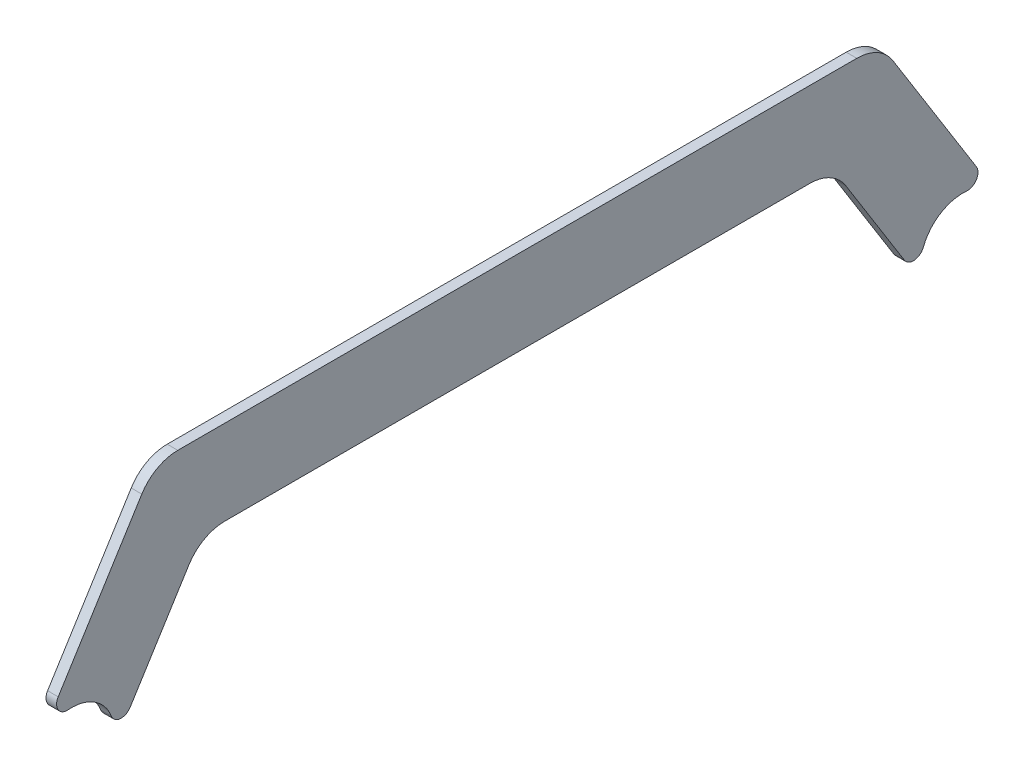
ISO-10303-21;
HEADER;
FILE_DESCRIPTION(('STEP AP214'),'2;1');
FILE_NAME('part.step','',(''),(''),'','','');
FILE_SCHEMA(('AUTOMOTIVE_DESIGN { 1 0 10303 214 1 1 1 1 }'));
ENDSEC;
DATA;
#1=APPLICATION_CONTEXT('core data for automotive mechanical design processes');
#2=APPLICATION_PROTOCOL_DEFINITION('international standard','automotive_design',2000,#1);
#3=PRODUCT_CONTEXT('',#1,'mechanical');
#4=PRODUCT('Part','Part','',(#3));
#5=PRODUCT_RELATED_PRODUCT_CATEGORY('part','',(#4));
#6=PRODUCT_DEFINITION_FORMATION('','',#4);
#7=PRODUCT_DEFINITION_CONTEXT('part definition',#1,'design');
#8=PRODUCT_DEFINITION('design','',#6,#7);
#9=PRODUCT_DEFINITION_SHAPE('','',#8);
#10=(LENGTH_UNIT() NAMED_UNIT(*) SI_UNIT(.MILLI.,.METRE.));
#11=(NAMED_UNIT(*) PLANE_ANGLE_UNIT() SI_UNIT($,.RADIAN.));
#12=(NAMED_UNIT(*) SI_UNIT($,.STERADIAN.) SOLID_ANGLE_UNIT());
#13=UNCERTAINTY_MEASURE_WITH_UNIT(LENGTH_MEASURE(1.E-05),#10,'distance_accuracy_value','');
#14=(GEOMETRIC_REPRESENTATION_CONTEXT(3) GLOBAL_UNCERTAINTY_ASSIGNED_CONTEXT((#13)) GLOBAL_UNIT_ASSIGNED_CONTEXT((#10,
#11,#12)) REPRESENTATION_CONTEXT('',''));
#15=CARTESIAN_POINT('',(0.,0.,0.));
#16=DIRECTION('',(0.,0.,1.));
#17=DIRECTION('',(1.,0.,0.));
#18=AXIS2_PLACEMENT_3D('',#15,#16,#17);
#19=CARTESIAN_POINT('',(51.560492731366,140.184391258715,136.591610014411));
#20=DIRECTION('',(-1.,0.,0.));
#21=DIRECTION('',(0.,0.,1.));
#22=AXIS2_PLACEMENT_3D('',#19,#20,#21);
#23=CYLINDRICAL_SURFACE('',#22,12.7);
#24=CARTESIAN_POINT('',(48.385492731366,140.184391258715,136.591610014411));
#25=DIRECTION('',(-1.,0.,0.));
#26=DIRECTION('',(0.,0.,1.));
#27=AXIS2_PLACEMENT_3D('',#24,#25,#26);
#28=CIRCLE('',#27,12.7);
#29=CARTESIAN_POINT('',(48.385492731366,152.83864595023,137.668567860498));
#30=VERTEX_POINT('',#29);
#31=CARTESIAN_POINT('',(48.385492731366,144.761462104582,124.74507370746));
#32=VERTEX_POINT('',#31);
#33=EDGE_CURVE('E258',#30,#32,#28,.T.);
#34=ORIENTED_EDGE('',*,*,#33,.T.);
#35=DIRECTION('',(-1.,0.,0.));
#36=VECTOR('',#35,1.);
#37=CARTESIAN_POINT('',(51.560492731366,144.761462104582,124.74507370746));
#38=LINE('',#37,#36);
#39=CARTESIAN_POINT('',(51.560492731366,144.761462104582,124.74507370746));
#40=VERTEX_POINT('',#39);
#41=EDGE_CURVE('E212',#32,#40,#38,.F.);
#42=ORIENTED_EDGE('',*,*,#41,.T.);
#43=CARTESIAN_POINT('',(51.560492731366,140.184391258715,136.591610014411));
#44=DIRECTION('',(-1.,0.,0.));
#45=DIRECTION('',(0.,0.,1.));
#46=AXIS2_PLACEMENT_3D('',#43,#44,#45);
#47=CIRCLE('',#46,12.7);
#48=CARTESIAN_POINT('',(51.560492731366,152.83864595023,137.668567860498));
#49=VERTEX_POINT('',#48);
#50=EDGE_CURVE('E184',#49,#40,#47,.T.);
#51=ORIENTED_EDGE('',*,*,#50,.F.);
#52=DIRECTION('',(-1.,0.,0.));
#53=VECTOR('',#52,1.);
#54=CARTESIAN_POINT('',(51.560492731366,152.83864595023,137.668567860498));
#55=LINE('',#54,#53);
#56=EDGE_CURVE('E209',#49,#30,#55,.T.);
#57=ORIENTED_EDGE('',*,*,#56,.T.);
#58=EDGE_LOOP('',(#34,#42,#51,#57));
#59=FACE_BOUND('',#58,.T.);
#60=ADVANCED_FACE('F33',(#59),#23,.F.);
#61=CARTESIAN_POINT('',(51.560492731366,178.284391258715,97.8026649672712));
#62=DIRECTION('',(0.,0.529998940003181,0.847998304005087));
#63=DIRECTION('',(0.,-0.847998304005087,0.529998940003181));
#64=AXIS2_PLACEMENT_3D('',#61,#62,#63);
#65=PLANE('',#64);
#66=DIRECTION('',(0.,0.847998304005087,-0.529998940003181));
#67=VECTOR('',#66,1.);
#68=CARTESIAN_POINT('',(48.385492731366,178.284391258715,97.8026649672712));
#69=LINE('',#68,#67);
#70=CARTESIAN_POINT('',(48.385492731366,144.222983181539,119.091045015506));
#71=VERTEX_POINT('',#70);
#72=CARTESIAN_POINT('',(48.385492731366,172.315377796755,101.533298380996));
#73=VERTEX_POINT('',#72);
#74=EDGE_CURVE('E248',#71,#73,#69,.T.);
#75=ORIENTED_EDGE('',*,*,#74,.T.);
#76=DIRECTION('',(-1.,0.,0.));
#77=VECTOR('',#76,1.);
#78=CARTESIAN_POINT('',(51.560492731366,172.315377796755,101.533298380996));
#79=LINE('',#78,#77);
#80=CARTESIAN_POINT('',(51.560492731366,172.315377796755,101.533298380996));
#81=VERTEX_POINT('',#80);
#82=EDGE_CURVE('E238',#73,#81,#79,.F.);
#83=ORIENTED_EDGE('',*,*,#82,.T.);
#84=DIRECTION('',(0.,0.847998304005087,-0.529998940003181));
#85=VECTOR('',#84,1.);
#86=CARTESIAN_POINT('',(51.560492731366,178.284391258715,97.8026649672712));
#87=LINE('',#86,#85);
#88=CARTESIAN_POINT('',(51.560492731366,144.222983181539,119.091045015506));
#89=VERTEX_POINT('',#88);
#90=EDGE_CURVE('E264',#89,#81,#87,.T.);
#91=ORIENTED_EDGE('',*,*,#90,.F.);
#92=DIRECTION('',(-1.,0.,0.));
#93=VECTOR('',#92,1.);
#94=CARTESIAN_POINT('',(51.560492731366,144.222983181539,119.091045015506));
#95=LINE('',#94,#93);
#96=EDGE_CURVE('E206',#89,#71,#95,.T.);
#97=ORIENTED_EDGE('',*,*,#96,.T.);
#98=EDGE_LOOP('',(#75,#83,#91,#97));
#99=FACE_BOUND('',#98,.T.);
#100=ADVANCED_FACE('F254',(#99),#65,.F.);
#101=CARTESIAN_POINT('',(51.560492731366,178.284391258715,-91.319444938449));
#102=DIRECTION('',(0.,1.,0.));
#103=DIRECTION('',(0.,0.,1.));
#104=AXIS2_PLACEMENT_3D('',#101,#102,#103);
#105=PLANE('',#104);
#106=DIRECTION('',(0.,0.,-1.));
#107=VECTOR('',#106,1.);
#108=CARTESIAN_POINT('',(48.385492731366,178.284391258715,-91.319444938449));
#109=LINE('',#108,#107);
#110=CARTESIAN_POINT('',(48.385492731366,178.284391258715,90.7637199201313));
#111=VERTEX_POINT('',#110);
#112=CARTESIAN_POINT('',(48.385492731366,178.284391258715,-84.2804998913092));
#113=VERTEX_POINT('',#112);
#114=EDGE_CURVE('E249',#111,#113,#109,.T.);
#115=ORIENTED_EDGE('',*,*,#114,.T.);
#116=DIRECTION('',(-1.,0.,0.));
#117=VECTOR('',#116,1.);
#118=CARTESIAN_POINT('',(51.560492731366,178.284391258715,-84.2804998913092));
#119=LINE('',#118,#117);
#120=CARTESIAN_POINT('',(51.560492731366,178.284391258715,-84.2804998913092));
#121=VERTEX_POINT('',#120);
#122=EDGE_CURVE('E56',#113,#121,#119,.F.);
#123=ORIENTED_EDGE('',*,*,#122,.T.);
#124=DIRECTION('',(0.,0.,-1.));
#125=VECTOR('',#124,1.);
#126=CARTESIAN_POINT('',(51.560492731366,178.284391258715,-91.319444938449));
#127=LINE('',#126,#125);
#128=CARTESIAN_POINT('',(51.560492731366,178.284391258715,90.7637199201313));
#129=VERTEX_POINT('',#128);
#130=EDGE_CURVE('E263',#129,#121,#127,.T.);
#131=ORIENTED_EDGE('',*,*,#130,.F.);
#132=DIRECTION('',(-1.,0.,0.));
#133=VECTOR('',#132,1.);
#134=CARTESIAN_POINT('',(48.385492731366,178.284391258715,90.7637199201313));
#135=LINE('',#134,#133);
#136=EDGE_CURVE('E234',#129,#111,#135,.T.);
#137=ORIENTED_EDGE('',*,*,#136,.T.);
#138=EDGE_LOOP('',(#115,#123,#131,#137));
#139=FACE_BOUND('',#138,.T.);
#140=ADVANCED_FACE('F265',(#139),#105,.F.);
#141=CARTESIAN_POINT('',(51.560492731366,133.453404720674,-119.338811524724));
#142=DIRECTION('',(0.,0.52999894000318,-0.847998304005088));
#143=DIRECTION('',(0.,0.847998304005088,0.52999894000318));
#144=AXIS2_PLACEMENT_3D('',#141,#142,#143);
#145=PLANE('',#144);
#146=DIRECTION('',(0.,-0.847998304005088,-0.52999894000318));
#147=VECTOR('',#146,1.);
#148=CARTESIAN_POINT('',(51.560492731366,133.453404720674,-119.338811524724));
#149=LINE('',#148,#147);
#150=CARTESIAN_POINT('',(51.560492731366,172.315377796755,-95.0500783521738));
#151=VERTEX_POINT('',#150);
#152=CARTESIAN_POINT('',(51.560492731366,144.222983181539,-112.607824986684));
#153=VERTEX_POINT('',#152);
#154=EDGE_CURVE('E266',#151,#153,#149,.T.);
#155=ORIENTED_EDGE('',*,*,#154,.F.);
#156=DIRECTION('',(-1.,0.,0.));
#157=VECTOR('',#156,1.);
#158=CARTESIAN_POINT('',(48.385492731366,172.315377796755,-95.0500783521738));
#159=LINE('',#158,#157);
#160=CARTESIAN_POINT('',(48.385492731366,172.315377796755,-95.0500783521738));
#161=VERTEX_POINT('',#160);
#162=EDGE_CURVE('E231',#151,#161,#159,.T.);
#163=ORIENTED_EDGE('',*,*,#162,.T.);
#164=DIRECTION('',(0.,-0.847998304005088,-0.52999894000318));
#165=VECTOR('',#164,1.);
#166=CARTESIAN_POINT('',(48.385492731366,133.453404720674,-119.338811524724));
#167=LINE('',#166,#165);
#168=CARTESIAN_POINT('',(48.385492731366,144.222983181539,-112.607824986684));
#169=VERTEX_POINT('',#168);
#170=EDGE_CURVE('E180',#161,#169,#167,.T.);
#171=ORIENTED_EDGE('',*,*,#170,.T.);
#172=DIRECTION('',(-1.,0.,0.));
#173=VECTOR('',#172,1.);
#174=CARTESIAN_POINT('',(51.560492731366,144.222983181539,-112.607824986684));
#175=LINE('',#174,#173);
#176=EDGE_CURVE('E203',#169,#153,#175,.F.);
#177=ORIENTED_EDGE('',*,*,#176,.T.);
#178=EDGE_LOOP('',(#155,#163,#171,#177));
#179=FACE_BOUND('',#178,.T.);
#180=ADVANCED_FACE('F284',(#179),#145,.F.);
#181=CARTESIAN_POINT('',(51.560492731366,140.184391258715,-130.108389985589));
#182=DIRECTION('',(-1.,0.,0.));
#183=DIRECTION('',(0.,0.,1.));
#184=AXIS2_PLACEMENT_3D('',#181,#182,#183);
#185=CYLINDRICAL_SURFACE('',#184,12.7);
#186=CARTESIAN_POINT('',(48.385492731366,140.184391258715,-130.108389985589));
#187=DIRECTION('',(-1.,0.,0.));
#188=DIRECTION('',(0.,0.,-1.));
#189=AXIS2_PLACEMENT_3D('',#186,#187,#188);
#190=CIRCLE('',#189,12.7);
#191=CARTESIAN_POINT('',(48.385492731366,144.761462104582,-118.261853678638));
#192=VERTEX_POINT('',#191);
#193=CARTESIAN_POINT('',(48.385492731366,152.83864595023,-131.185347831675));
#194=VERTEX_POINT('',#193);
#195=EDGE_CURVE('E175',#192,#194,#190,.T.);
#196=ORIENTED_EDGE('',*,*,#195,.T.);
#197=DIRECTION('',(-1.,0.,0.));
#198=VECTOR('',#197,1.);
#199=CARTESIAN_POINT('',(51.560492731366,152.83864595023,-131.185347831675));
#200=LINE('',#199,#198);
#201=CARTESIAN_POINT('',(51.560492731366,152.83864595023,-131.185347831675));
#202=VERTEX_POINT('',#201);
#203=EDGE_CURVE('E152',#194,#202,#200,.F.);
#204=ORIENTED_EDGE('',*,*,#203,.T.);
#205=CARTESIAN_POINT('',(51.560492731366,140.184391258715,-130.108389985589));
#206=DIRECTION('',(-1.,0.,0.));
#207=DIRECTION('',(0.,0.,-1.));
#208=AXIS2_PLACEMENT_3D('',#205,#206,#207);
#209=CIRCLE('',#208,12.7);
#210=CARTESIAN_POINT('',(51.560492731366,144.761462104582,-118.261853678638));
#211=VERTEX_POINT('',#210);
#212=EDGE_CURVE('E268',#211,#202,#209,.T.);
#213=ORIENTED_EDGE('',*,*,#212,.F.);
#214=DIRECTION('',(-1.,0.,0.));
#215=VECTOR('',#214,1.);
#216=CARTESIAN_POINT('',(51.560492731366,144.761462104582,-118.261853678638));
#217=LINE('',#216,#215);
#218=EDGE_CURVE('E157',#211,#192,#217,.T.);
#219=ORIENTED_EDGE('',*,*,#218,.T.);
#220=EDGE_LOOP('',(#196,#204,#213,#219));
#221=FACE_BOUND('',#220,.T.);
#222=ADVANCED_FACE('F293',(#221),#185,.F.);
#223=CARTESIAN_POINT('',(51.560492731366,203.684391258715,-105.397335032729));
#224=DIRECTION('',(0.,-0.52999894000318,0.847998304005088));
#225=DIRECTION('',(0.,-0.847998304005088,-0.52999894000318));
#226=AXIS2_PLACEMENT_3D('',#223,#224,#225);
#227=PLANE('',#226);
#228=DIRECTION('',(0.,0.847998304005088,0.52999894000318));
#229=VECTOR('',#228,1.);
#230=CARTESIAN_POINT('',(48.385492731366,203.684391258715,-105.397335032729));
#231=LINE('',#230,#229);
#232=CARTESIAN_POINT('',(48.385492731366,157.68495625762,-134.146981908413));
#233=VERTEX_POINT('',#232);
#234=CARTESIAN_POINT('',(48.385492731366,197.715377796755,-109.127968446453));
#235=VERTEX_POINT('',#234);
#236=EDGE_CURVE('E164',#233,#235,#231,.T.);
#237=ORIENTED_EDGE('',*,*,#236,.T.);
#238=DIRECTION('',(-1.,0.,0.));
#239=VECTOR('',#238,1.);
#240=CARTESIAN_POINT('',(51.560492731366,197.715377796755,-109.127968446453));
#241=LINE('',#240,#239);
#242=CARTESIAN_POINT('',(51.560492731366,197.715377796755,-109.127968446453));
#243=VERTEX_POINT('',#242);
#244=EDGE_CURVE('E225',#235,#243,#241,.F.);
#245=ORIENTED_EDGE('',*,*,#244,.T.);
#246=DIRECTION('',(0.,0.847998304005088,0.52999894000318));
#247=VECTOR('',#246,1.);
#248=CARTESIAN_POINT('',(51.560492731366,203.684391258715,-105.397335032729));
#249=LINE('',#248,#247);
#250=CARTESIAN_POINT('',(51.560492731366,157.68495625762,-134.146981908413));
#251=VERTEX_POINT('',#250);
#252=EDGE_CURVE('E167',#251,#243,#249,.T.);
#253=ORIENTED_EDGE('',*,*,#252,.F.);
#254=DIRECTION('',(-1.,0.,0.));
#255=VECTOR('',#254,1.);
#256=CARTESIAN_POINT('',(51.560492731366,157.68495625762,-134.146981908413));
#257=LINE('',#256,#255);
#258=EDGE_CURVE('E151',#251,#233,#257,.T.);
#259=ORIENTED_EDGE('',*,*,#258,.T.);
#260=EDGE_LOOP('',(#237,#245,#253,#259));
#261=FACE_BOUND('',#260,.T.);
#262=ADVANCED_FACE('F163',(#261),#227,.F.);
#263=CARTESIAN_POINT('',(51.560492731366,203.684391258715,111.880555061551));
#264=DIRECTION('',(0.,-1.,0.));
#265=DIRECTION('',(0.,0.,-1.));
#266=AXIS2_PLACEMENT_3D('',#263,#264,#265);
#267=PLANE('',#266);
#268=DIRECTION('',(0.,0.,1.));
#269=VECTOR('',#268,1.);
#270=CARTESIAN_POINT('',(51.560492731366,203.684391258715,111.880555061551));
#271=LINE('',#270,#269);
#272=CARTESIAN_POINT('',(51.560492731366,203.684391258715,-98.3583899855889));
#273=VERTEX_POINT('',#272);
#274=CARTESIAN_POINT('',(51.560492731366,203.684391258715,104.841610014411));
#275=VERTEX_POINT('',#274);
#276=EDGE_CURVE('E276',#273,#275,#271,.T.);
#277=ORIENTED_EDGE('',*,*,#276,.F.);
#278=DIRECTION('',(-1.,0.,0.));
#279=VECTOR('',#278,1.);
#280=CARTESIAN_POINT('',(51.560492731366,203.684391258715,-98.3583899855889));
#281=LINE('',#280,#279);
#282=CARTESIAN_POINT('',(48.385492731366,203.684391258715,-98.3583899855889));
#283=VERTEX_POINT('',#282);
#284=EDGE_CURVE('E219',#273,#283,#281,.T.);
#285=ORIENTED_EDGE('',*,*,#284,.T.);
#286=DIRECTION('',(0.,0.,1.));
#287=VECTOR('',#286,1.);
#288=CARTESIAN_POINT('',(48.385492731366,203.684391258715,111.880555061551));
#289=LINE('',#288,#287);
#290=CARTESIAN_POINT('',(48.385492731366,203.684391258715,104.841610014411));
#291=VERTEX_POINT('',#290);
#292=EDGE_CURVE('E174',#283,#291,#289,.T.);
#293=ORIENTED_EDGE('',*,*,#292,.T.);
#294=DIRECTION('',(-1.,0.,0.));
#295=VECTOR('',#294,1.);
#296=CARTESIAN_POINT('',(51.560492731366,203.684391258715,104.841610014411));
#297=LINE('',#296,#295);
#298=EDGE_CURVE('E217',#291,#275,#297,.F.);
#299=ORIENTED_EDGE('',*,*,#298,.T.);
#300=EDGE_LOOP('',(#277,#285,#293,#299));
#301=FACE_BOUND('',#300,.T.);
#302=ADVANCED_FACE('F300',(#301),#267,.F.);
#303=CARTESIAN_POINT('',(51.560492731366,146.915377796755,147.361188475276));
#304=DIRECTION('',(0.,-0.529998940003181,-0.847998304005087));
#305=DIRECTION('',(0.,0.847998304005088,-0.529998940003181));
#306=AXIS2_PLACEMENT_3D('',#303,#304,#305);
#307=PLANE('',#306);
#308=DIRECTION('',(0.,-0.847998304005087,0.529998940003181));
#309=VECTOR('',#308,1.);
#310=CARTESIAN_POINT('',(51.560492731366,146.915377796755,147.361188475276));
#311=LINE('',#310,#309);
#312=CARTESIAN_POINT('',(51.560492731366,197.715377796755,115.611188475276));
#313=VERTEX_POINT('',#312);
#314=CARTESIAN_POINT('',(51.560492731366,157.68495625762,140.630201937235));
#315=VERTEX_POINT('',#314);
#316=EDGE_CURVE('E169',#313,#315,#311,.T.);
#317=ORIENTED_EDGE('',*,*,#316,.F.);
#318=DIRECTION('',(-1.,0.,0.));
#319=VECTOR('',#318,1.);
#320=CARTESIAN_POINT('',(51.560492731366,197.715377796755,115.611188475276));
#321=LINE('',#320,#319);
#322=CARTESIAN_POINT('',(48.385492731366,197.715377796755,115.611188475276));
#323=VERTEX_POINT('',#322);
#324=EDGE_CURVE('E240',#313,#323,#321,.T.);
#325=ORIENTED_EDGE('',*,*,#324,.T.);
#326=DIRECTION('',(0.,-0.847998304005087,0.529998940003181));
#327=VECTOR('',#326,1.);
#328=CARTESIAN_POINT('',(48.385492731366,146.915377796755,147.361188475276));
#329=LINE('',#328,#327);
#330=CARTESIAN_POINT('',(48.385492731366,157.68495625762,140.630201937235));
#331=VERTEX_POINT('',#330);
#332=EDGE_CURVE('E178',#323,#331,#329,.T.);
#333=ORIENTED_EDGE('',*,*,#332,.T.);
#334=DIRECTION('',(-1.,0.,0.));
#335=VECTOR('',#334,1.);
#336=CARTESIAN_POINT('',(51.560492731366,157.68495625762,140.630201937235));
#337=LINE('',#336,#335);
#338=EDGE_CURVE('E214',#331,#315,#337,.F.);
#339=ORIENTED_EDGE('',*,*,#338,.T.);
#340=EDGE_LOOP('',(#317,#325,#333,#339));
#341=FACE_BOUND('',#340,.T.);
#342=ADVANCED_FACE('F344',(#341),#307,.F.);
#343=CARTESIAN_POINT('',(51.560492731366,140.184391258715,136.591610014411));
#344=DIRECTION('',(-1.,0.,0.));
#345=DIRECTION('',(0.,0.,1.));
#346=AXIS2_PLACEMENT_3D('',#343,#344,#345);
#347=PLANE('',#346);
#348=ORIENTED_EDGE('',*,*,#252,.T.);
#349=CARTESIAN_POINT('',(51.560492731366,190.984391258715,-98.3583899855889));
#350=DIRECTION('',(-1.,0.,0.));
#351=DIRECTION('',(0.,0.,1.));
#352=AXIS2_PLACEMENT_3D('',#349,#350,#351);
#353=CIRCLE('',#352,12.7);
#354=EDGE_CURVE('E229',#243,#273,#353,.F.);
#355=ORIENTED_EDGE('',*,*,#354,.T.);
#356=ORIENTED_EDGE('',*,*,#276,.T.);
#357=CARTESIAN_POINT('',(51.560492731366,190.984391258715,104.841610014411));
#358=DIRECTION('',(-1.,0.,0.));
#359=DIRECTION('',(0.,0.,1.));
#360=AXIS2_PLACEMENT_3D('',#357,#358,#359);
#361=CIRCLE('',#360,12.7);
#362=EDGE_CURVE('E227',#275,#313,#361,.F.);
#363=ORIENTED_EDGE('',*,*,#362,.T.);
#364=ORIENTED_EDGE('',*,*,#316,.T.);
#365=CARTESIAN_POINT('',(51.560492731366,156.002209623109,137.937807322019));
#366=DIRECTION('',(-1.,0.,0.));
#367=DIRECTION('',(0.,0.,1.));
#368=AXIS2_PLACEMENT_3D('',#365,#366,#367);
#369=CIRCLE('',#368,3.175);
#370=EDGE_CURVE('E195',#315,#49,#369,.F.);
#371=ORIENTED_EDGE('',*,*,#370,.T.);
#372=ORIENTED_EDGE('',*,*,#50,.T.);
#373=CARTESIAN_POINT('',(51.560492731366,145.905729816049,121.783439630722));
#374=DIRECTION('',(-1.,0.,0.));
#375=DIRECTION('',(0.,0.,1.));
#376=AXIS2_PLACEMENT_3D('',#373,#374,#375);
#377=CIRCLE('',#376,3.175);
#378=EDGE_CURVE('E197',#40,#89,#377,.F.);
#379=ORIENTED_EDGE('',*,*,#378,.T.);
#380=ORIENTED_EDGE('',*,*,#90,.T.);
#381=CARTESIAN_POINT('',(51.560492731366,165.584391258715,90.7637199201313));
#382=DIRECTION('',(-1.,0.,0.));
#383=DIRECTION('',(0.,0.,1.));
#384=AXIS2_PLACEMENT_3D('',#381,#382,#383);
#385=CIRCLE('',#384,12.7);
#386=EDGE_CURVE('E11',#81,#129,#385,.T.);
#387=ORIENTED_EDGE('',*,*,#386,.T.);
#388=ORIENTED_EDGE('',*,*,#130,.T.);
#389=CARTESIAN_POINT('',(51.560492731366,165.584391258715,-84.2804998913092));
#390=DIRECTION('',(-1.,0.,0.));
#391=DIRECTION('',(0.,0.,1.));
#392=AXIS2_PLACEMENT_3D('',#389,#390,#391);
#393=CIRCLE('',#392,12.7);
#394=EDGE_CURVE('E48',#121,#151,#393,.T.);
#395=ORIENTED_EDGE('',*,*,#394,.T.);
#396=ORIENTED_EDGE('',*,*,#154,.T.);
#397=CARTESIAN_POINT('',(51.560492731366,145.905729816049,-115.3002196019));
#398=DIRECTION('',(-1.,0.,0.));
#399=DIRECTION('',(0.,0.,1.));
#400=AXIS2_PLACEMENT_3D('',#397,#398,#399);
#401=CIRCLE('',#400,3.175);
#402=EDGE_CURVE('E199',#153,#211,#401,.F.);
#403=ORIENTED_EDGE('',*,*,#402,.T.);
#404=ORIENTED_EDGE('',*,*,#212,.T.);
#405=CARTESIAN_POINT('',(51.560492731366,156.002209623109,-131.454587293197));
#406=DIRECTION('',(-1.,0.,0.));
#407=DIRECTION('',(0.,0.,1.));
#408=AXIS2_PLACEMENT_3D('',#405,#406,#407);
#409=CIRCLE('',#408,3.175);
#410=EDGE_CURVE('E201',#202,#251,#409,.F.);
#411=ORIENTED_EDGE('',*,*,#410,.T.);
#412=EDGE_LOOP('',(#348,#355,#356,#363,#364,#371,#372,#379,#380,#387,#388,#395,#396,#403,#404,#411));
#413=FACE_BOUND('',#412,.T.);
#414=ADVANCED_FACE('F262',(#413),#347,.F.);
#415=CARTESIAN_POINT('',(48.385492731366,140.184391258715,136.591610014411));
#416=DIRECTION('',(-1.,0.,0.));
#417=DIRECTION('',(0.,0.,1.));
#418=AXIS2_PLACEMENT_3D('',#415,#416,#417);
#419=PLANE('',#418);
#420=ORIENTED_EDGE('',*,*,#292,.F.);
#421=CARTESIAN_POINT('',(48.385492731366,190.984391258715,-98.3583899855889));
#422=DIRECTION('',(-1.,0.,0.));
#423=DIRECTION('',(0.,0.,1.));
#424=AXIS2_PLACEMENT_3D('',#421,#422,#423);
#425=CIRCLE('',#424,12.7);
#426=EDGE_CURVE('E173',#283,#235,#425,.T.);
#427=ORIENTED_EDGE('',*,*,#426,.T.);
#428=ORIENTED_EDGE('',*,*,#236,.F.);
#429=CARTESIAN_POINT('',(48.385492731366,156.002209623109,-131.454587293197));
#430=DIRECTION('',(-1.,0.,0.));
#431=DIRECTION('',(0.,0.,1.));
#432=AXIS2_PLACEMENT_3D('',#429,#430,#431);
#433=CIRCLE('',#432,3.175);
#434=EDGE_CURVE('E147',#233,#194,#433,.T.);
#435=ORIENTED_EDGE('',*,*,#434,.T.);
#436=ORIENTED_EDGE('',*,*,#195,.F.);
#437=CARTESIAN_POINT('',(48.385492731366,145.905729816049,-115.3002196019));
#438=DIRECTION('',(-1.,0.,0.));
#439=DIRECTION('',(0.,0.,1.));
#440=AXIS2_PLACEMENT_3D('',#437,#438,#439);
#441=CIRCLE('',#440,3.175);
#442=EDGE_CURVE('E158',#192,#169,#441,.T.);
#443=ORIENTED_EDGE('',*,*,#442,.T.);
#444=ORIENTED_EDGE('',*,*,#170,.F.);
#445=CARTESIAN_POINT('',(48.385492731366,165.584391258715,-84.2804998913092));
#446=DIRECTION('',(-1.,0.,0.));
#447=DIRECTION('',(0.,0.,1.));
#448=AXIS2_PLACEMENT_3D('',#445,#446,#447);
#449=CIRCLE('',#448,12.7);
#450=EDGE_CURVE('E243',#161,#113,#449,.F.);
#451=ORIENTED_EDGE('',*,*,#450,.T.);
#452=ORIENTED_EDGE('',*,*,#114,.F.);
#453=CARTESIAN_POINT('',(48.385492731366,165.584391258715,90.7637199201313));
#454=DIRECTION('',(-1.,0.,0.));
#455=DIRECTION('',(0.,0.,1.));
#456=AXIS2_PLACEMENT_3D('',#453,#454,#455);
#457=CIRCLE('',#456,12.7);
#458=EDGE_CURVE('E41',#111,#73,#457,.F.);
#459=ORIENTED_EDGE('',*,*,#458,.T.);
#460=ORIENTED_EDGE('',*,*,#74,.F.);
#461=CARTESIAN_POINT('',(48.385492731366,145.905729816049,121.783439630722));
#462=DIRECTION('',(-1.,0.,0.));
#463=DIRECTION('',(0.,0.,1.));
#464=AXIS2_PLACEMENT_3D('',#461,#462,#463);
#465=CIRCLE('',#464,3.175);
#466=EDGE_CURVE('E188',#71,#32,#465,.T.);
#467=ORIENTED_EDGE('',*,*,#466,.T.);
#468=ORIENTED_EDGE('',*,*,#33,.F.);
#469=CARTESIAN_POINT('',(48.385492731366,156.002209623109,137.937807322019));
#470=DIRECTION('',(-1.,0.,0.));
#471=DIRECTION('',(0.,0.,1.));
#472=AXIS2_PLACEMENT_3D('',#469,#470,#471);
#473=CIRCLE('',#472,3.175);
#474=EDGE_CURVE('E168',#30,#331,#473,.T.);
#475=ORIENTED_EDGE('',*,*,#474,.T.);
#476=ORIENTED_EDGE('',*,*,#332,.F.);
#477=CARTESIAN_POINT('',(48.385492731366,190.984391258715,104.841610014411));
#478=DIRECTION('',(-1.,0.,0.));
#479=DIRECTION('',(0.,0.,1.));
#480=AXIS2_PLACEMENT_3D('',#477,#478,#479);
#481=CIRCLE('',#480,12.7);
#482=EDGE_CURVE('E222',#323,#291,#481,.T.);
#483=ORIENTED_EDGE('',*,*,#482,.T.);
#484=EDGE_LOOP('',(#420,#427,#428,#435,#436,#443,#444,#451,#452,#459,#460,#467,#468,#475,#476,#483));
#485=FACE_BOUND('',#484,.T.);
#486=ADVANCED_FACE('F172',(#485),#419,.T.);
#487=CARTESIAN_POINT('',(51.560492731366,156.002209623109,-131.454587293197));
#488=DIRECTION('',(-1.,0.,0.));
#489=DIRECTION('',(0.,0.,1.));
#490=AXIS2_PLACEMENT_3D('',#487,#488,#489);
#491=CYLINDRICAL_SURFACE('',#490,3.175);
#492=ORIENTED_EDGE('',*,*,#410,.F.);
#493=ORIENTED_EDGE('',*,*,#203,.F.);
#494=ORIENTED_EDGE('',*,*,#434,.F.);
#495=ORIENTED_EDGE('',*,*,#258,.F.);
#496=EDGE_LOOP('',(#492,#493,#494,#495));
#497=FACE_BOUND('',#496,.T.);
#498=ADVANCED_FACE('F150',(#497),#491,.T.);
#499=CARTESIAN_POINT('',(51.560492731366,145.905729816049,-115.3002196019));
#500=DIRECTION('',(-1.,0.,0.));
#501=DIRECTION('',(0.,0.,1.));
#502=AXIS2_PLACEMENT_3D('',#499,#500,#501);
#503=CYLINDRICAL_SURFACE('',#502,3.175);
#504=ORIENTED_EDGE('',*,*,#402,.F.);
#505=ORIENTED_EDGE('',*,*,#176,.F.);
#506=ORIENTED_EDGE('',*,*,#442,.F.);
#507=ORIENTED_EDGE('',*,*,#218,.F.);
#508=EDGE_LOOP('',(#504,#505,#506,#507));
#509=FACE_BOUND('',#508,.T.);
#510=ADVANCED_FACE('F290',(#509),#503,.T.);
#511=CARTESIAN_POINT('',(51.560492731366,145.905729816049,121.783439630722));
#512=DIRECTION('',(-1.,0.,0.));
#513=DIRECTION('',(0.,0.,1.));
#514=AXIS2_PLACEMENT_3D('',#511,#512,#513);
#515=CYLINDRICAL_SURFACE('',#514,3.175);
#516=ORIENTED_EDGE('',*,*,#378,.F.);
#517=ORIENTED_EDGE('',*,*,#41,.F.);
#518=ORIENTED_EDGE('',*,*,#466,.F.);
#519=ORIENTED_EDGE('',*,*,#96,.F.);
#520=EDGE_LOOP('',(#516,#517,#518,#519));
#521=FACE_BOUND('',#520,.T.);
#522=ADVANCED_FACE('F316',(#521),#515,.T.);
#523=CARTESIAN_POINT('',(51.560492731366,156.002209623109,137.937807322019));
#524=DIRECTION('',(-1.,0.,0.));
#525=DIRECTION('',(0.,0.,1.));
#526=AXIS2_PLACEMENT_3D('',#523,#524,#525);
#527=CYLINDRICAL_SURFACE('',#526,3.175);
#528=ORIENTED_EDGE('',*,*,#370,.F.);
#529=ORIENTED_EDGE('',*,*,#338,.F.);
#530=ORIENTED_EDGE('',*,*,#474,.F.);
#531=ORIENTED_EDGE('',*,*,#56,.F.);
#532=EDGE_LOOP('',(#528,#529,#530,#531));
#533=FACE_BOUND('',#532,.T.);
#534=ADVANCED_FACE('F319',(#533),#527,.T.);
#535=CARTESIAN_POINT('',(51.560492731366,190.984391258715,-98.3583899855889));
#536=DIRECTION('',(-1.,0.,0.));
#537=DIRECTION('',(0.,0.,1.));
#538=AXIS2_PLACEMENT_3D('',#535,#536,#537);
#539=CYLINDRICAL_SURFACE('',#538,12.7);
#540=ORIENTED_EDGE('',*,*,#354,.F.);
#541=ORIENTED_EDGE('',*,*,#244,.F.);
#542=ORIENTED_EDGE('',*,*,#426,.F.);
#543=ORIENTED_EDGE('',*,*,#284,.F.);
#544=EDGE_LOOP('',(#540,#541,#542,#543));
#545=FACE_BOUND('',#544,.T.);
#546=ADVANCED_FACE('F323',(#545),#539,.T.);
#547=CARTESIAN_POINT('',(51.560492731366,165.584391258715,-84.2804998913092));
#548=DIRECTION('',(1.,0.,0.));
#549=DIRECTION('',(0.,0.,-1.));
#550=AXIS2_PLACEMENT_3D('',#547,#548,#549);
#551=CYLINDRICAL_SURFACE('',#550,12.7);
#552=ORIENTED_EDGE('',*,*,#394,.F.);
#553=ORIENTED_EDGE('',*,*,#122,.F.);
#554=ORIENTED_EDGE('',*,*,#450,.F.);
#555=ORIENTED_EDGE('',*,*,#162,.F.);
#556=EDGE_LOOP('',(#552,#553,#554,#555));
#557=FACE_BOUND('',#556,.T.);
#558=ADVANCED_FACE('F327',(#557),#551,.F.);
#559=CARTESIAN_POINT('',(51.560492731366,165.584391258715,90.7637199201313));
#560=DIRECTION('',(1.,0.,0.));
#561=DIRECTION('',(0.,0.,-1.));
#562=AXIS2_PLACEMENT_3D('',#559,#560,#561);
#563=CYLINDRICAL_SURFACE('',#562,12.7);
#564=ORIENTED_EDGE('',*,*,#386,.F.);
#565=ORIENTED_EDGE('',*,*,#82,.F.);
#566=ORIENTED_EDGE('',*,*,#458,.F.);
#567=ORIENTED_EDGE('',*,*,#136,.F.);
#568=EDGE_LOOP('',(#564,#565,#566,#567));
#569=FACE_BOUND('',#568,.T.);
#570=ADVANCED_FACE('F261',(#569),#563,.F.);
#571=CARTESIAN_POINT('',(51.560492731366,190.984391258715,104.841610014411));
#572=DIRECTION('',(-1.,0.,0.));
#573=DIRECTION('',(0.,0.,1.));
#574=AXIS2_PLACEMENT_3D('',#571,#572,#573);
#575=CYLINDRICAL_SURFACE('',#574,12.7);
#576=ORIENTED_EDGE('',*,*,#362,.F.);
#577=ORIENTED_EDGE('',*,*,#298,.F.);
#578=ORIENTED_EDGE('',*,*,#482,.F.);
#579=ORIENTED_EDGE('',*,*,#324,.F.);
#580=EDGE_LOOP('',(#576,#577,#578,#579));
#581=FACE_BOUND('',#580,.T.);
#582=ADVANCED_FACE('F35',(#581),#575,.T.);
#583=CLOSED_SHELL('',(#60,#100,#140,#180,#222,#262,#302,#342,#414,#486,#498,#510,#522,#534,#546,
#558,#570,#582));
#584=MANIFOLD_SOLID_BREP('B2',#583);
#585=ADVANCED_BREP_SHAPE_REPRESENTATION('',(#18,#584),#14);
#586=SHAPE_DEFINITION_REPRESENTATION(#9,#585);
ENDSEC;
END-ISO-10303-21;
